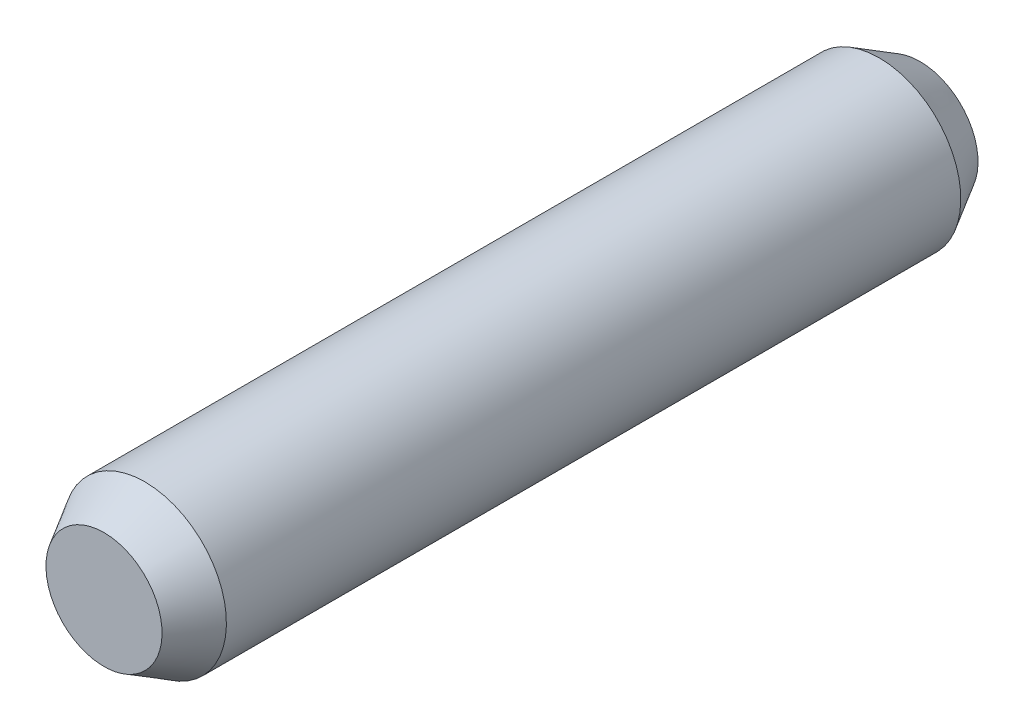
ISO-10303-21;
HEADER;
FILE_DESCRIPTION(('STEP AP214'),'2;1');
FILE_NAME('part.step','',(''),(''),'','','');
FILE_SCHEMA(('AUTOMOTIVE_DESIGN { 1 0 10303 214 1 1 1 1 }'));
ENDSEC;
DATA;
#1=APPLICATION_CONTEXT('core data for automotive mechanical design processes');
#2=APPLICATION_PROTOCOL_DEFINITION('international standard','automotive_design',2000,#1);
#3=PRODUCT_CONTEXT('',#1,'mechanical');
#4=PRODUCT('Part','Part','',(#3));
#5=PRODUCT_RELATED_PRODUCT_CATEGORY('part','',(#4));
#6=PRODUCT_DEFINITION_FORMATION('','',#4);
#7=PRODUCT_DEFINITION_CONTEXT('part definition',#1,'design');
#8=PRODUCT_DEFINITION('design','',#6,#7);
#9=PRODUCT_DEFINITION_SHAPE('','',#8);
#10=(LENGTH_UNIT() NAMED_UNIT(*) SI_UNIT(.MILLI.,.METRE.));
#11=(NAMED_UNIT(*) PLANE_ANGLE_UNIT() SI_UNIT($,.RADIAN.));
#12=(NAMED_UNIT(*) SI_UNIT($,.STERADIAN.) SOLID_ANGLE_UNIT());
#13=UNCERTAINTY_MEASURE_WITH_UNIT(LENGTH_MEASURE(1.E-05),#10,'distance_accuracy_value','');
#14=(GEOMETRIC_REPRESENTATION_CONTEXT(3) GLOBAL_UNCERTAINTY_ASSIGNED_CONTEXT((#13)) GLOBAL_UNIT_ASSIGNED_CONTEXT((#10,
#11,#12)) REPRESENTATION_CONTEXT('',''));
#15=CARTESIAN_POINT('',(0.,0.,0.));
#16=DIRECTION('',(0.,0.,1.));
#17=DIRECTION('',(1.,0.,0.));
#18=AXIS2_PLACEMENT_3D('',#15,#16,#17);
#19=CARTESIAN_POINT('',(0.,0.,27.));
#20=DIRECTION('',(0.,0.,-1.));
#21=DIRECTION('',(0.,1.,0.));
#22=AXIS2_PLACEMENT_3D('',#19,#20,#21);
#23=CONICAL_SURFACE('',#22,6.,0.523598775598296);
#24=CARTESIAN_POINT('',(0.,0.,30.));
#25=DIRECTION('',(0.,0.,-1.));
#26=DIRECTION('',(0.,1.,0.));
#27=AXIS2_PLACEMENT_3D('',#24,#25,#26);
#28=CIRCLE('',#27,4.26794919243114);
#29=CARTESIAN_POINT('',(0.,4.26794919243114,30.));
#30=VERTEX_POINT('',#29);
#31=EDGE_CURVE('E47',#30,#30,#28,.T.);
#32=ORIENTED_EDGE('',*,*,#31,.T.);
#33=EDGE_LOOP('',(#32));
#34=FACE_BOUND('',#33,.T.);
#35=CARTESIAN_POINT('',(0.,0.,27.));
#36=DIRECTION('',(0.,0.,-1.));
#37=DIRECTION('',(0.,1.,0.));
#38=AXIS2_PLACEMENT_3D('',#35,#36,#37);
#39=CIRCLE('',#38,6.);
#40=CARTESIAN_POINT('',(0.,6.,27.));
#41=VERTEX_POINT('',#40);
#42=EDGE_CURVE('E10',#41,#41,#39,.T.);
#43=ORIENTED_EDGE('',*,*,#42,.F.);
#44=EDGE_LOOP('',(#43));
#45=FACE_BOUND('',#44,.T.);
#46=ADVANCED_FACE('F33',(#34,#45),#23,.T.);
#47=CARTESIAN_POINT('',(0.,0.,-30.));
#48=DIRECTION('',(0.,0.,-1.));
#49=DIRECTION('',(0.,1.,0.));
#50=AXIS2_PLACEMENT_3D('',#47,#48,#49);
#51=CYLINDRICAL_SURFACE('',#50,6.);
#52=ORIENTED_EDGE('',*,*,#42,.T.);
#53=EDGE_LOOP('',(#52));
#54=FACE_BOUND('',#53,.T.);
#55=CARTESIAN_POINT('',(0.,0.,-27.));
#56=DIRECTION('',(0.,0.,-1.));
#57=DIRECTION('',(0.,1.,0.));
#58=AXIS2_PLACEMENT_3D('',#55,#56,#57);
#59=CIRCLE('',#58,6.);
#60=CARTESIAN_POINT('',(0.,6.00000000000001,-27.));
#61=VERTEX_POINT('',#60);
#62=EDGE_CURVE('E39',#61,#61,#59,.T.);
#63=ORIENTED_EDGE('',*,*,#62,.F.);
#64=EDGE_LOOP('',(#63));
#65=FACE_BOUND('',#64,.T.);
#66=ADVANCED_FACE('F66',(#54,#65),#51,.T.);
#67=CARTESIAN_POINT('',(0.,0.,-30.));
#68=DIRECTION('',(0.,0.,1.));
#69=DIRECTION('',(0.,-1.,0.));
#70=AXIS2_PLACEMENT_3D('',#67,#68,#69);
#71=CONICAL_SURFACE('',#70,4.26794919243114,0.523598775598296);
#72=ORIENTED_EDGE('',*,*,#62,.T.);
#73=EDGE_LOOP('',(#72));
#74=FACE_BOUND('',#73,.T.);
#75=CARTESIAN_POINT('',(0.,0.,-30.));
#76=DIRECTION('',(0.,0.,-1.));
#77=DIRECTION('',(0.,1.,0.));
#78=AXIS2_PLACEMENT_3D('',#75,#76,#77);
#79=CIRCLE('',#78,4.26794919243114);
#80=CARTESIAN_POINT('',(0.,4.26794919243114,-30.));
#81=VERTEX_POINT('',#80);
#82=EDGE_CURVE('E43',#81,#81,#79,.T.);
#83=ORIENTED_EDGE('',*,*,#82,.F.);
#84=EDGE_LOOP('',(#83));
#85=FACE_BOUND('',#84,.T.);
#86=ADVANCED_FACE('F62',(#74,#85),#71,.T.);
#87=CARTESIAN_POINT('',(0.,4.26794919243114,-30.));
#88=DIRECTION('',(0.,0.,-1.));
#89=DIRECTION('',(0.,1.,0.));
#90=AXIS2_PLACEMENT_3D('',#87,#88,#89);
#91=PLANE('',#90);
#92=ORIENTED_EDGE('',*,*,#82,.T.);
#93=EDGE_LOOP('',(#92));
#94=FACE_BOUND('',#93,.T.);
#95=ADVANCED_FACE('F57',(#94),#91,.T.);
#96=CARTESIAN_POINT('',(0.,0.,30.));
#97=DIRECTION('',(0.,0.,1.));
#98=DIRECTION('',(0.,-1.,0.));
#99=AXIS2_PLACEMENT_3D('',#96,#97,#98);
#100=PLANE('',#99);
#101=ORIENTED_EDGE('',*,*,#31,.F.);
#102=EDGE_LOOP('',(#101));
#103=FACE_BOUND('',#102,.T.);
#104=ADVANCED_FACE('F55',(#103),#100,.T.);
#105=CLOSED_SHELL('',(#46,#66,#86,#95,#104));
#106=MANIFOLD_SOLID_BREP('B2',#105);
#107=ADVANCED_BREP_SHAPE_REPRESENTATION('',(#18,#106),#14);
#108=SHAPE_DEFINITION_REPRESENTATION(#9,#107);
ENDSEC;
END-ISO-10303-21;
